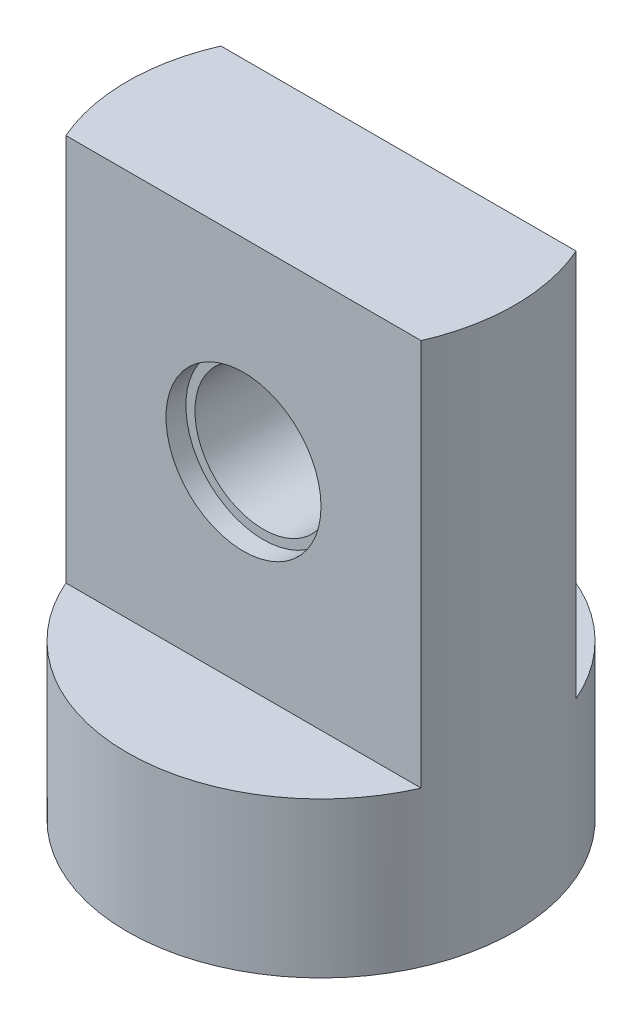
ISO-10303-21;
HEADER;
FILE_DESCRIPTION(('STEP AP214'),'2;1');
FILE_NAME('part.step','',(''),(''),'','','');
FILE_SCHEMA(('AUTOMOTIVE_DESIGN { 1 0 10303 214 1 1 1 1 }'));
ENDSEC;
DATA;
#1=APPLICATION_CONTEXT('core data for automotive mechanical design processes');
#2=APPLICATION_PROTOCOL_DEFINITION('international standard','automotive_design',2000,#1);
#3=PRODUCT_CONTEXT('',#1,'mechanical');
#4=PRODUCT('Part','Part','',(#3));
#5=PRODUCT_RELATED_PRODUCT_CATEGORY('part','',(#4));
#6=PRODUCT_DEFINITION_FORMATION('','',#4);
#7=PRODUCT_DEFINITION_CONTEXT('part definition',#1,'design');
#8=PRODUCT_DEFINITION('design','',#6,#7);
#9=PRODUCT_DEFINITION_SHAPE('','',#8);
#10=(LENGTH_UNIT() NAMED_UNIT(*) SI_UNIT(.MILLI.,.METRE.));
#11=(NAMED_UNIT(*) PLANE_ANGLE_UNIT() SI_UNIT($,.RADIAN.));
#12=(NAMED_UNIT(*) SI_UNIT($,.STERADIAN.) SOLID_ANGLE_UNIT());
#13=UNCERTAINTY_MEASURE_WITH_UNIT(LENGTH_MEASURE(1.E-05),#10,'distance_accuracy_value','');
#14=(GEOMETRIC_REPRESENTATION_CONTEXT(3) GLOBAL_UNCERTAINTY_ASSIGNED_CONTEXT((#13)) GLOBAL_UNIT_ASSIGNED_CONTEXT((#10,
#11,#12)) REPRESENTATION_CONTEXT('',''));
#15=CARTESIAN_POINT('',(0.,0.,0.));
#16=DIRECTION('',(0.,0.,1.));
#17=DIRECTION('',(1.,0.,0.));
#18=AXIS2_PLACEMENT_3D('',#15,#16,#17);
#19=CARTESIAN_POINT('',(0.,13.5,-3.));
#20=DIRECTION('',(0.,0.,1.));
#21=DIRECTION('',(1.,0.,0.));
#22=AXIS2_PLACEMENT_3D('',#19,#20,#21);
#23=CYLINDRICAL_SURFACE('',#22,2.65);
#24=CARTESIAN_POINT('',(0.,13.5,-3.));
#25=DIRECTION('',(0.,0.,1.));
#26=DIRECTION('',(1.,0.,0.));
#27=AXIS2_PLACEMENT_3D('',#24,#25,#26);
#28=CIRCLE('',#27,2.65);
#29=CARTESIAN_POINT('',(2.65,13.5,-3.));
#30=VERTEX_POINT('',#29);
#31=EDGE_CURVE('E103',#30,#30,#28,.T.);
#32=ORIENTED_EDGE('',*,*,#31,.F.);
#33=EDGE_LOOP('',(#32));
#34=FACE_BOUND('',#33,.T.);
#35=CARTESIAN_POINT('',(0.,13.5,2.23));
#36=DIRECTION('',(0.,0.,1.));
#37=DIRECTION('',(1.,0.,0.));
#38=AXIS2_PLACEMENT_3D('',#35,#36,#37);
#39=CIRCLE('',#38,2.65);
#40=CARTESIAN_POINT('',(2.65,13.5,2.23));
#41=VERTEX_POINT('',#40);
#42=EDGE_CURVE('E51',#41,#41,#39,.F.);
#43=ORIENTED_EDGE('',*,*,#42,.F.);
#44=EDGE_LOOP('',(#43));
#45=FACE_BOUND('',#44,.T.);
#46=ADVANCED_FACE('F47',(#34,#45),#23,.F.);
#47=CARTESIAN_POINT('',(0.,6.,0.));
#48=DIRECTION('',(0.,1.,0.));
#49=DIRECTION('',(0.,0.,1.));
#50=AXIS2_PLACEMENT_3D('',#47,#48,#49);
#51=PLANE('',#50);
#52=CARTESIAN_POINT('',(0.,6.,0.));
#53=DIRECTION('',(0.,1.,0.));
#54=DIRECTION('',(0.,0.,1.));
#55=AXIS2_PLACEMENT_3D('',#52,#53,#54);
#56=CIRCLE('',#55,7.5);
#57=CARTESIAN_POINT('',(-6.87386354243376,6.,3.));
#58=VERTEX_POINT('',#57);
#59=CARTESIAN_POINT('',(6.87386354243376,6.,3.));
#60=VERTEX_POINT('',#59);
#61=EDGE_CURVE('E110',#58,#60,#56,.T.);
#62=ORIENTED_EDGE('',*,*,#61,.T.);
#63=DIRECTION('',(-1.,0.,0.));
#64=VECTOR('',#63,1.);
#65=CARTESIAN_POINT('',(0.,6.,3.));
#66=LINE('',#65,#64);
#67=EDGE_CURVE('E12',#60,#58,#66,.T.);
#68=ORIENTED_EDGE('',*,*,#67,.T.);
#69=EDGE_LOOP('',(#62,#68));
#70=FACE_BOUND('',#69,.T.);
#71=ADVANCED_FACE('F118',(#70),#51,.T.);
#72=CARTESIAN_POINT('',(6.87386354243376,6.,-3.));
#73=VERTEX_POINT('',#72);
#74=CARTESIAN_POINT('',(-6.87386354243376,6.,-3.));
#75=VERTEX_POINT('',#74);
#76=EDGE_CURVE('E62',#73,#75,#56,.T.);
#77=ORIENTED_EDGE('',*,*,#76,.T.);
#78=DIRECTION('',(1.,0.,0.));
#79=VECTOR('',#78,1.);
#80=CARTESIAN_POINT('',(0.,6.,-3.));
#81=LINE('',#80,#79);
#82=EDGE_CURVE('E56',#75,#73,#81,.T.);
#83=ORIENTED_EDGE('',*,*,#82,.T.);
#84=EDGE_LOOP('',(#77,#83));
#85=FACE_BOUND('',#84,.T.);
#86=ADVANCED_FACE('F151',(#85),#51,.T.);
#87=CARTESIAN_POINT('',(0.,0.,0.));
#88=DIRECTION('',(0.,1.,0.));
#89=DIRECTION('',(0.,0.,1.));
#90=AXIS2_PLACEMENT_3D('',#87,#88,#89);
#91=PLANE('',#90);
#92=CARTESIAN_POINT('',(0.,0.,0.));
#93=DIRECTION('',(0.,-1.,0.));
#94=DIRECTION('',(0.,0.,-1.));
#95=AXIS2_PLACEMENT_3D('',#92,#93,#94);
#96=CIRCLE('',#95,2.3);
#97=CARTESIAN_POINT('',(0.,0.,-2.3));
#98=VERTEX_POINT('',#97);
#99=EDGE_CURVE('E133',#98,#98,#96,.T.);
#100=ORIENTED_EDGE('',*,*,#99,.F.);
#101=EDGE_LOOP('',(#100));
#102=FACE_BOUND('',#101,.T.);
#103=CARTESIAN_POINT('',(0.,0.,0.));
#104=DIRECTION('',(0.,1.,0.));
#105=DIRECTION('',(0.,0.,1.));
#106=AXIS2_PLACEMENT_3D('',#103,#104,#105);
#107=CIRCLE('',#106,7.5);
#108=CARTESIAN_POINT('',(0.,0.,7.5));
#109=VERTEX_POINT('',#108);
#110=EDGE_CURVE('E107',#109,#109,#107,.T.);
#111=ORIENTED_EDGE('',*,*,#110,.F.);
#112=EDGE_LOOP('',(#111));
#113=FACE_BOUND('',#112,.T.);
#114=ADVANCED_FACE('F148',(#102,#113),#91,.F.);
#115=CARTESIAN_POINT('',(0.,6.,0.));
#116=DIRECTION('',(0.,-1.,0.));
#117=DIRECTION('',(0.,0.,-1.));
#118=AXIS2_PLACEMENT_3D('',#115,#116,#117);
#119=CYLINDRICAL_SURFACE('',#118,7.5);
#120=ORIENTED_EDGE('',*,*,#110,.T.);
#121=EDGE_LOOP('',(#120));
#122=FACE_BOUND('',#121,.T.);
#123=DIRECTION('',(0.,-1.,0.));
#124=VECTOR('',#123,1.);
#125=CARTESIAN_POINT('',(6.87386354243376,21.,3.));
#126=LINE('',#125,#124);
#127=CARTESIAN_POINT('',(6.87386354243376,21.,3.));
#128=VERTEX_POINT('',#127);
#129=EDGE_CURVE('E88',#128,#60,#126,.T.);
#130=ORIENTED_EDGE('',*,*,#129,.T.);
#131=ORIENTED_EDGE('',*,*,#61,.F.);
#132=DIRECTION('',(0.,-1.,0.));
#133=VECTOR('',#132,1.);
#134=CARTESIAN_POINT('',(-6.87386354243376,21.,3.));
#135=LINE('',#134,#133);
#136=CARTESIAN_POINT('',(-6.87386354243376,21.,3.));
#137=VERTEX_POINT('',#136);
#138=EDGE_CURVE('E119',#137,#58,#135,.T.);
#139=ORIENTED_EDGE('',*,*,#138,.F.);
#140=CARTESIAN_POINT('',(0.,21.,0.));
#141=DIRECTION('',(0.,1.,0.));
#142=DIRECTION('',(0.,0.,1.));
#143=AXIS2_PLACEMENT_3D('',#140,#141,#142);
#144=CIRCLE('',#143,7.5);
#145=CARTESIAN_POINT('',(-6.87386354243376,21.,-3.));
#146=VERTEX_POINT('',#145);
#147=EDGE_CURVE('E96',#146,#137,#144,.T.);
#148=ORIENTED_EDGE('',*,*,#147,.F.);
#149=DIRECTION('',(0.,-1.,0.));
#150=VECTOR('',#149,1.);
#151=CARTESIAN_POINT('',(-6.87386354243376,21.,-3.));
#152=LINE('',#151,#150);
#153=EDGE_CURVE('E112',#146,#75,#152,.T.);
#154=ORIENTED_EDGE('',*,*,#153,.T.);
#155=ORIENTED_EDGE('',*,*,#76,.F.);
#156=DIRECTION('',(0.,-1.,0.));
#157=VECTOR('',#156,1.);
#158=CARTESIAN_POINT('',(6.87386354243376,21.,-3.));
#159=LINE('',#158,#157);
#160=CARTESIAN_POINT('',(6.87386354243376,21.,-3.));
#161=VERTEX_POINT('',#160);
#162=EDGE_CURVE('E90',#161,#73,#159,.T.);
#163=ORIENTED_EDGE('',*,*,#162,.F.);
#164=EDGE_CURVE('E85',#128,#161,#144,.T.);
#165=ORIENTED_EDGE('',*,*,#164,.F.);
#166=EDGE_LOOP('',(#130,#131,#139,#148,#154,#155,#163,#165));
#167=FACE_BOUND('',#166,.T.);
#168=ADVANCED_FACE('F49',(#122,#167),#119,.T.);
#169=CARTESIAN_POINT('',(0.,21.,3.));
#170=DIRECTION('',(0.,0.,-1.));
#171=DIRECTION('',(-1.,0.,0.));
#172=AXIS2_PLACEMENT_3D('',#169,#170,#171);
#173=PLANE('',#172);
#174=CARTESIAN_POINT('',(0.,13.5,3.));
#175=DIRECTION('',(0.,0.,1.));
#176=DIRECTION('',(1.,0.,0.));
#177=AXIS2_PLACEMENT_3D('',#174,#175,#176);
#178=CIRCLE('',#177,3.);
#179=CARTESIAN_POINT('',(3.,13.5,3.));
#180=VERTEX_POINT('',#179);
#181=EDGE_CURVE('E126',#180,#180,#178,.T.);
#182=ORIENTED_EDGE('',*,*,#181,.F.);
#183=EDGE_LOOP('',(#182));
#184=FACE_BOUND('',#183,.T.);
#185=ORIENTED_EDGE('',*,*,#67,.F.);
#186=ORIENTED_EDGE('',*,*,#129,.F.);
#187=DIRECTION('',(1.,0.,0.));
#188=VECTOR('',#187,1.);
#189=CARTESIAN_POINT('',(0.,21.,3.));
#190=LINE('',#189,#188);
#191=EDGE_CURVE('E94',#137,#128,#190,.T.);
#192=ORIENTED_EDGE('',*,*,#191,.F.);
#193=ORIENTED_EDGE('',*,*,#138,.T.);
#194=EDGE_LOOP('',(#185,#186,#192,#193));
#195=FACE_BOUND('',#194,.T.);
#196=ADVANCED_FACE('F106',(#184,#195),#173,.F.);
#197=CARTESIAN_POINT('',(0.,21.,-3.));
#198=DIRECTION('',(0.,0.,1.));
#199=DIRECTION('',(1.,0.,0.));
#200=AXIS2_PLACEMENT_3D('',#197,#198,#199);
#201=PLANE('',#200);
#202=ORIENTED_EDGE('',*,*,#31,.T.);
#203=EDGE_LOOP('',(#202));
#204=FACE_BOUND('',#203,.T.);
#205=ORIENTED_EDGE('',*,*,#82,.F.);
#206=ORIENTED_EDGE('',*,*,#153,.F.);
#207=DIRECTION('',(-1.,0.,0.));
#208=VECTOR('',#207,1.);
#209=CARTESIAN_POINT('',(0.,21.,-3.));
#210=LINE('',#209,#208);
#211=EDGE_CURVE('E93',#161,#146,#210,.T.);
#212=ORIENTED_EDGE('',*,*,#211,.F.);
#213=ORIENTED_EDGE('',*,*,#162,.T.);
#214=EDGE_LOOP('',(#205,#206,#212,#213));
#215=FACE_BOUND('',#214,.T.);
#216=ADVANCED_FACE('F158',(#204,#215),#201,.F.);
#217=CARTESIAN_POINT('',(0.,21.,0.));
#218=DIRECTION('',(0.,1.,0.));
#219=DIRECTION('',(0.,0.,1.));
#220=AXIS2_PLACEMENT_3D('',#217,#218,#219);
#221=PLANE('',#220);
#222=ORIENTED_EDGE('',*,*,#191,.T.);
#223=ORIENTED_EDGE('',*,*,#164,.T.);
#224=ORIENTED_EDGE('',*,*,#211,.T.);
#225=ORIENTED_EDGE('',*,*,#147,.T.);
#226=EDGE_LOOP('',(#222,#223,#224,#225));
#227=FACE_BOUND('',#226,.T.);
#228=ADVANCED_FACE('F98',(#227),#221,.T.);
#229=CARTESIAN_POINT('',(0.,13.5,2.23));
#230=DIRECTION('',(0.,0.,1.));
#231=DIRECTION('',(1.,0.,0.));
#232=AXIS2_PLACEMENT_3D('',#229,#230,#231);
#233=PLANE('',#232);
#234=CARTESIAN_POINT('',(0.,13.5,2.23));
#235=DIRECTION('',(0.,0.,1.));
#236=DIRECTION('',(1.,0.,0.));
#237=AXIS2_PLACEMENT_3D('',#234,#235,#236);
#238=CIRCLE('',#237,3.);
#239=CARTESIAN_POINT('',(3.,13.5,2.23));
#240=VERTEX_POINT('',#239);
#241=EDGE_CURVE('E129',#240,#240,#238,.T.);
#242=ORIENTED_EDGE('',*,*,#241,.T.);
#243=EDGE_LOOP('',(#242));
#244=FACE_BOUND('',#243,.T.);
#245=ORIENTED_EDGE('',*,*,#42,.T.);
#246=EDGE_LOOP('',(#245));
#247=FACE_BOUND('',#246,.T.);
#248=ADVANCED_FACE('F175',(#244,#247),#233,.T.);
#249=CARTESIAN_POINT('',(0.,13.5,2.23));
#250=DIRECTION('',(0.,0.,1.));
#251=DIRECTION('',(1.,0.,0.));
#252=AXIS2_PLACEMENT_3D('',#249,#250,#251);
#253=CYLINDRICAL_SURFACE('',#252,3.);
#254=ORIENTED_EDGE('',*,*,#241,.F.);
#255=EDGE_LOOP('',(#254));
#256=FACE_BOUND('',#255,.T.);
#257=ORIENTED_EDGE('',*,*,#181,.T.);
#258=EDGE_LOOP('',(#257));
#259=FACE_BOUND('',#258,.T.);
#260=ADVANCED_FACE('F144',(#256,#259),#253,.F.);
#261=CARTESIAN_POINT('',(0.,6.,0.));
#262=DIRECTION('',(0.,-1.,0.));
#263=DIRECTION('',(0.,0.,-1.));
#264=AXIS2_PLACEMENT_3D('',#261,#262,#263);
#265=CYLINDRICAL_SURFACE('',#264,2.3);
#266=CARTESIAN_POINT('',(0.,6.,0.));
#267=DIRECTION('',(0.,-1.,0.));
#268=DIRECTION('',(0.,0.,-1.));
#269=AXIS2_PLACEMENT_3D('',#266,#267,#268);
#270=CIRCLE('',#269,2.3);
#271=CARTESIAN_POINT('',(0.,6.,-2.3));
#272=VERTEX_POINT('',#271);
#273=EDGE_CURVE('E130',#272,#272,#270,.T.);
#274=ORIENTED_EDGE('',*,*,#273,.F.);
#275=EDGE_LOOP('',(#274));
#276=FACE_BOUND('',#275,.T.);
#277=ORIENTED_EDGE('',*,*,#99,.T.);
#278=EDGE_LOOP('',(#277));
#279=FACE_BOUND('',#278,.T.);
#280=ADVANCED_FACE('F141',(#276,#279),#265,.F.);
#281=CARTESIAN_POINT('',(0.,6.,0.));
#282=DIRECTION('',(0.,-1.,0.));
#283=DIRECTION('',(0.,0.,-1.));
#284=AXIS2_PLACEMENT_3D('',#281,#282,#283);
#285=PLANE('',#284);
#286=ORIENTED_EDGE('',*,*,#273,.T.);
#287=EDGE_LOOP('',(#286));
#288=FACE_BOUND('',#287,.T.);
#289=ADVANCED_FACE('F139',(#288),#285,.T.);
#290=CLOSED_SHELL('',(#46,#71,#86,#114,#168,#196,#216,#228,#248,#260,#280,#289));
#291=MANIFOLD_SOLID_BREP('B2',#290);
#292=ADVANCED_BREP_SHAPE_REPRESENTATION('',(#18,#291),#14);
#293=SHAPE_DEFINITION_REPRESENTATION(#9,#292);
ENDSEC;
END-ISO-10303-21;
